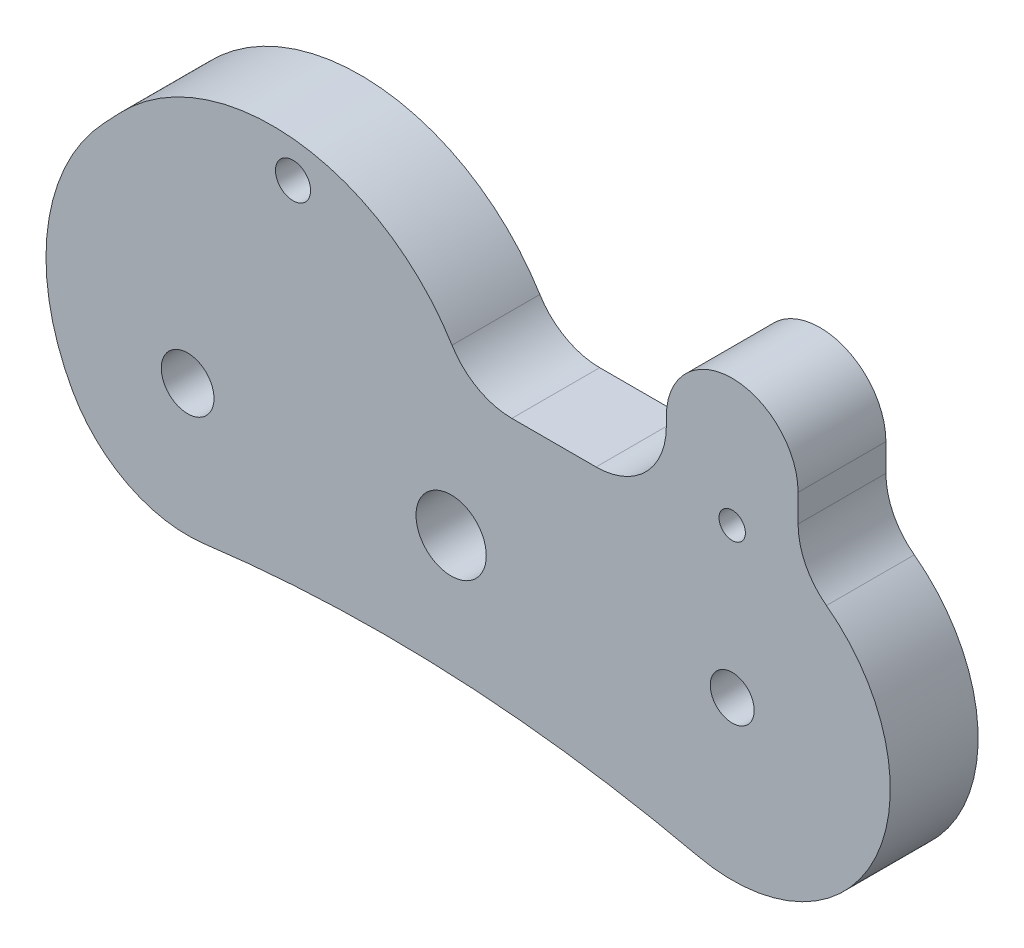
ISO-10303-21;
HEADER;
FILE_DESCRIPTION(('STEP AP214'),'2;1');
FILE_NAME('part.step','',(''),(''),'','','');
FILE_SCHEMA(('AUTOMOTIVE_DESIGN { 1 0 10303 214 1 1 1 1 }'));
ENDSEC;
DATA;
#1=APPLICATION_CONTEXT('core data for automotive mechanical design processes');
#2=APPLICATION_PROTOCOL_DEFINITION('international standard','automotive_design',2000,#1);
#3=PRODUCT_CONTEXT('',#1,'mechanical');
#4=PRODUCT('Part','Part','',(#3));
#5=PRODUCT_RELATED_PRODUCT_CATEGORY('part','',(#4));
#6=PRODUCT_DEFINITION_FORMATION('','',#4);
#7=PRODUCT_DEFINITION_CONTEXT('part definition',#1,'design');
#8=PRODUCT_DEFINITION('design','',#6,#7);
#9=PRODUCT_DEFINITION_SHAPE('','',#8);
#10=(LENGTH_UNIT() NAMED_UNIT(*) SI_UNIT(.MILLI.,.METRE.));
#11=(NAMED_UNIT(*) PLANE_ANGLE_UNIT() SI_UNIT($,.RADIAN.));
#12=(NAMED_UNIT(*) SI_UNIT($,.STERADIAN.) SOLID_ANGLE_UNIT());
#13=UNCERTAINTY_MEASURE_WITH_UNIT(LENGTH_MEASURE(1.E-05),#10,'distance_accuracy_value','');
#14=(GEOMETRIC_REPRESENTATION_CONTEXT(3) GLOBAL_UNCERTAINTY_ASSIGNED_CONTEXT((#13)) GLOBAL_UNIT_ASSIGNED_CONTEXT((#10,
#11,#12)) REPRESENTATION_CONTEXT('',''));
#15=CARTESIAN_POINT('',(0.,0.,0.));
#16=DIRECTION('',(0.,0.,1.));
#17=DIRECTION('',(1.,0.,0.));
#18=AXIS2_PLACEMENT_3D('',#15,#16,#17);
#19=CARTESIAN_POINT('',(23.25,11.5,5.));
#20=DIRECTION('',(0.,0.,-1.));
#21=DIRECTION('',(-1.,0.,0.));
#22=AXIS2_PLACEMENT_3D('',#19,#20,#21);
#23=PLANE('',#22);
#24=CARTESIAN_POINT('',(23.25,11.5,5.));
#25=DIRECTION('',(0.,0.,-1.));
#26=DIRECTION('',(-1.,0.,0.));
#27=AXIS2_PLACEMENT_3D('',#24,#25,#26);
#28=CIRCLE('',#27,4.);
#29=CARTESIAN_POINT('',(27.25,11.5,5.));
#30=VERTEX_POINT('',#29);
#31=CARTESIAN_POINT('',(23.25,7.5,5.));
#32=VERTEX_POINT('',#31);
#33=EDGE_CURVE('E193',#30,#32,#28,.T.);
#34=ORIENTED_EDGE('',*,*,#33,.T.);
#35=DIRECTION('',(-1.,0.,0.));
#36=VECTOR('',#35,1.);
#37=CARTESIAN_POINT('',(18.4574990044832,7.5,5.));
#38=LINE('',#37,#36);
#39=CARTESIAN_POINT('',(18.4574990044832,7.5,5.));
#40=VERTEX_POINT('',#39);
#41=EDGE_CURVE('E116',#32,#40,#38,.T.);
#42=ORIENTED_EDGE('',*,*,#41,.T.);
#43=CARTESIAN_POINT('',(18.4574990044832,11.5,5.));
#44=DIRECTION('',(0.,0.,-1.));
#45=DIRECTION('',(-1.,0.,0.));
#46=AXIS2_PLACEMENT_3D('',#43,#44,#45);
#47=CIRCLE('',#46,4.);
#48=CARTESIAN_POINT('',(15.0502614745966,9.40459254202613,5.));
#49=VERTEX_POINT('',#48);
#50=EDGE_CURVE('E223',#40,#49,#47,.T.);
#51=ORIENTED_EDGE('',*,*,#50,.T.);
#52=CARTESIAN_POINT('',(4.82854888493694,3.11837016810453,5.));
#53=DIRECTION('',(0.,0.,1.));
#54=DIRECTION('',(-1.,0.,0.));
#55=AXIS2_PLACEMENT_3D('',#52,#53,#54);
#56=CIRCLE('',#55,12.);
#57=CARTESIAN_POINT('',(-3.87966329350652,11.3747035343882,5.));
#58=VERTEX_POINT('',#57);
#59=EDGE_CURVE('E242',#49,#58,#56,.T.);
#60=ORIENTED_EDGE('',*,*,#59,.T.);
#61=DIRECTION('',(-0.688027780523639,-0.725684348203622,0.));
#62=VECTOR('',#61,1.);
#63=CARTESIAN_POINT('',(-3.87966329350652,11.3747035343882,5.));
#64=LINE('',#63,#62);
#65=CARTESIAN_POINT('',(-4.77071217844346,10.4348864985253,5.));
#66=VERTEX_POINT('',#65);
#67=EDGE_CURVE('E239',#58,#66,#64,.T.);
#68=ORIENTED_EDGE('',*,*,#67,.T.);
#69=CARTESIAN_POINT('',(3.9375,2.17855313224167,5.));
#70=DIRECTION('',(0.,0.,1.));
#71=DIRECTION('',(-1.,0.,0.));
#72=AXIS2_PLACEMENT_3D('',#69,#70,#71);
#73=CIRCLE('',#72,12.);
#74=CARTESIAN_POINT('',(-6.5625,-3.63092188706945,5.));
#75=VERTEX_POINT('',#74);
#76=EDGE_CURVE('E241',#66,#75,#73,.T.);
#77=ORIENTED_EDGE('',*,*,#76,.T.);
#78=CARTESIAN_POINT('',(0.,0.,5.));
#79=DIRECTION('',(0.,0.,1.));
#80=DIRECTION('',(1.,0.,0.));
#81=AXIS2_PLACEMENT_3D('',#78,#79,#80);
#82=CIRCLE('',#81,7.5);
#83=CARTESIAN_POINT('',(0.962557603686643,-7.43797572324521,5.));
#84=VERTEX_POINT('',#83);
#85=EDGE_CURVE('E244',#75,#84,#82,.T.);
#86=ORIENTED_EDGE('',*,*,#85,.T.);
#87=CARTESIAN_POINT('',(11.2298387096774,-86.7763834378607,5.));
#88=DIRECTION('',(0.,0.,-1.));
#89=DIRECTION('',(-1.,0.,0.));
#90=AXIS2_PLACEMENT_3D('',#87,#88,#89);
#91=CIRCLE('',#90,80.);
#92=CARTESIAN_POINT('',(29.0007702065966,-8.77513989821064,5.));
#93=VERTEX_POINT('',#92);
#94=EDGE_CURVE('E250',#84,#93,#91,.T.);
#95=ORIENTED_EDGE('',*,*,#94,.T.);
#96=CARTESIAN_POINT('',(31.,0.,5.));
#97=DIRECTION('',(0.,0.,1.));
#98=DIRECTION('',(1.,0.,0.));
#99=AXIS2_PLACEMENT_3D('',#96,#97,#98);
#100=CIRCLE('',#99,9.00000000000001);
#101=CARTESIAN_POINT('',(36.3653846153846,7.22583198870512,5.));
#102=VERTEX_POINT('',#101);
#103=EDGE_CURVE('E252',#93,#102,#100,.T.);
#104=ORIENTED_EDGE('',*,*,#103,.T.);
#105=CARTESIAN_POINT('',(38.75,10.4373128725741,5.));
#106=DIRECTION('',(0.,0.,-1.));
#107=DIRECTION('',(-1.,0.,0.));
#108=AXIS2_PLACEMENT_3D('',#105,#106,#107);
#109=CIRCLE('',#108,4.);
#110=CARTESIAN_POINT('',(34.75,10.4373128725741,5.));
#111=VERTEX_POINT('',#110);
#112=EDGE_CURVE('E150',#102,#111,#109,.T.);
#113=ORIENTED_EDGE('',*,*,#112,.T.);
#114=DIRECTION('',(0.,1.,0.));
#115=VECTOR('',#114,1.);
#116=CARTESIAN_POINT('',(34.75,12.,5.));
#117=LINE('',#116,#115);
#118=CARTESIAN_POINT('',(34.75,12.,5.));
#119=VERTEX_POINT('',#118);
#120=EDGE_CURVE('E144',#111,#119,#117,.T.);
#121=ORIENTED_EDGE('',*,*,#120,.T.);
#122=CARTESIAN_POINT('',(31.,12.,5.));
#123=DIRECTION('',(0.,0.,1.));
#124=DIRECTION('',(1.,0.,0.));
#125=AXIS2_PLACEMENT_3D('',#122,#123,#124);
#126=CIRCLE('',#125,3.75);
#127=CARTESIAN_POINT('',(27.25,12.,5.));
#128=VERTEX_POINT('',#127);
#129=EDGE_CURVE('E148',#119,#128,#126,.T.);
#130=ORIENTED_EDGE('',*,*,#129,.T.);
#131=DIRECTION('',(0.,-1.,0.));
#132=VECTOR('',#131,1.);
#133=CARTESIAN_POINT('',(27.25,12.,5.));
#134=LINE('',#133,#132);
#135=EDGE_CURVE('E58',#128,#30,#134,.T.);
#136=ORIENTED_EDGE('',*,*,#135,.T.);
#137=EDGE_LOOP('',(#34,#42,#51,#60,#68,#77,#86,#95,#104,#113,#121,#130,#136));
#138=FACE_BOUND('',#137,.T.);
#139=CARTESIAN_POINT('',(0.,0.,5.));
#140=DIRECTION('',(0.,0.,1.));
#141=DIRECTION('',(1.,0.,0.));
#142=AXIS2_PLACEMENT_3D('',#139,#140,#141);
#143=CIRCLE('',#142,1.5);
#144=CARTESIAN_POINT('',(1.5,0.,5.));
#145=VERTEX_POINT('',#144);
#146=EDGE_CURVE('E172',#145,#145,#143,.T.);
#147=ORIENTED_EDGE('',*,*,#146,.F.);
#148=EDGE_LOOP('',(#147));
#149=FACE_BOUND('',#148,.T.);
#150=CARTESIAN_POINT('',(31.,0.,5.));
#151=DIRECTION('',(0.,0.,1.));
#152=DIRECTION('',(1.,0.,0.));
#153=AXIS2_PLACEMENT_3D('',#150,#151,#152);
#154=CIRCLE('',#153,1.25);
#155=CARTESIAN_POINT('',(32.25,0.,5.));
#156=VERTEX_POINT('',#155);
#157=EDGE_CURVE('E326',#156,#156,#154,.T.);
#158=ORIENTED_EDGE('',*,*,#157,.F.);
#159=EDGE_LOOP('',(#158));
#160=FACE_BOUND('',#159,.T.);
#161=CARTESIAN_POINT('',(15.,0.,5.));
#162=DIRECTION('',(0.,0.,1.));
#163=DIRECTION('',(1.,0.,0.));
#164=AXIS2_PLACEMENT_3D('',#161,#162,#163);
#165=CIRCLE('',#164,2.);
#166=CARTESIAN_POINT('',(17.,0.,5.));
#167=VERTEX_POINT('',#166);
#168=EDGE_CURVE('E320',#167,#167,#165,.T.);
#169=ORIENTED_EDGE('',*,*,#168,.F.);
#170=EDGE_LOOP('',(#169));
#171=FACE_BOUND('',#170,.T.);
#172=CARTESIAN_POINT('',(6.,13.,5.));
#173=DIRECTION('',(0.,0.,1.));
#174=DIRECTION('',(1.,0.,0.));
#175=AXIS2_PLACEMENT_3D('',#172,#173,#174);
#176=CIRCLE('',#175,0.999999999999998);
#177=CARTESIAN_POINT('',(7.,13.,5.));
#178=VERTEX_POINT('',#177);
#179=EDGE_CURVE('E314',#178,#178,#176,.T.);
#180=ORIENTED_EDGE('',*,*,#179,.F.);
#181=EDGE_LOOP('',(#180));
#182=FACE_BOUND('',#181,.T.);
#183=CARTESIAN_POINT('',(31.,8.5,5.));
#184=DIRECTION('',(0.,0.,1.));
#185=DIRECTION('',(1.,0.,0.));
#186=AXIS2_PLACEMENT_3D('',#183,#184,#185);
#187=CIRCLE('',#186,0.749999999999995);
#188=CARTESIAN_POINT('',(31.75,8.5,5.));
#189=VERTEX_POINT('',#188);
#190=EDGE_CURVE('E305',#189,#189,#187,.T.);
#191=ORIENTED_EDGE('',*,*,#190,.F.);
#192=EDGE_LOOP('',(#191));
#193=FACE_BOUND('',#192,.T.);
#194=ADVANCED_FACE('F41',(#138,#149,#160,#171,#182,#193),#23,.F.);
#195=CARTESIAN_POINT('',(23.25,11.5,0.));
#196=DIRECTION('',(0.,0.,-1.));
#197=DIRECTION('',(-1.,0.,0.));
#198=AXIS2_PLACEMENT_3D('',#195,#196,#197);
#199=PLANE('',#198);
#200=CARTESIAN_POINT('',(6.,13.,0.));
#201=DIRECTION('',(0.,0.,1.));
#202=DIRECTION('',(1.,0.,0.));
#203=AXIS2_PLACEMENT_3D('',#200,#201,#202);
#204=CIRCLE('',#203,0.999999999999998);
#205=CARTESIAN_POINT('',(7.,13.,0.));
#206=VERTEX_POINT('',#205);
#207=EDGE_CURVE('E311',#206,#206,#204,.T.);
#208=ORIENTED_EDGE('',*,*,#207,.T.);
#209=EDGE_LOOP('',(#208));
#210=FACE_BOUND('',#209,.T.);
#211=CARTESIAN_POINT('',(31.,0.,0.));
#212=DIRECTION('',(0.,0.,1.));
#213=DIRECTION('',(1.,0.,0.));
#214=AXIS2_PLACEMENT_3D('',#211,#212,#213);
#215=CIRCLE('',#214,1.25);
#216=CARTESIAN_POINT('',(32.25,0.,0.));
#217=VERTEX_POINT('',#216);
#218=EDGE_CURVE('E323',#217,#217,#215,.T.);
#219=ORIENTED_EDGE('',*,*,#218,.T.);
#220=EDGE_LOOP('',(#219));
#221=FACE_BOUND('',#220,.T.);
#222=CARTESIAN_POINT('',(23.25,11.5,0.));
#223=DIRECTION('',(0.,0.,-1.));
#224=DIRECTION('',(-1.,0.,0.));
#225=AXIS2_PLACEMENT_3D('',#222,#223,#224);
#226=CIRCLE('',#225,4.);
#227=CARTESIAN_POINT('',(27.25,11.5,0.));
#228=VERTEX_POINT('',#227);
#229=CARTESIAN_POINT('',(23.25,7.5,0.));
#230=VERTEX_POINT('',#229);
#231=EDGE_CURVE('E168',#228,#230,#226,.T.);
#232=ORIENTED_EDGE('',*,*,#231,.F.);
#233=DIRECTION('',(0.,-1.,0.));
#234=VECTOR('',#233,1.);
#235=CARTESIAN_POINT('',(27.25,12.,0.));
#236=LINE('',#235,#234);
#237=CARTESIAN_POINT('',(27.25,12.,0.));
#238=VERTEX_POINT('',#237);
#239=EDGE_CURVE('E108',#238,#228,#236,.T.);
#240=ORIENTED_EDGE('',*,*,#239,.F.);
#241=CARTESIAN_POINT('',(31.,12.,0.));
#242=DIRECTION('',(0.,0.,1.));
#243=DIRECTION('',(1.,0.,0.));
#244=AXIS2_PLACEMENT_3D('',#241,#242,#243);
#245=CIRCLE('',#244,3.75);
#246=CARTESIAN_POINT('',(34.75,12.,0.));
#247=VERTEX_POINT('',#246);
#248=EDGE_CURVE('E102',#247,#238,#245,.T.);
#249=ORIENTED_EDGE('',*,*,#248,.F.);
#250=DIRECTION('',(0.,1.,0.));
#251=VECTOR('',#250,1.);
#252=CARTESIAN_POINT('',(34.75,12.,0.));
#253=LINE('',#252,#251);
#254=CARTESIAN_POINT('',(34.75,10.4373128725741,0.));
#255=VERTEX_POINT('',#254);
#256=EDGE_CURVE('E158',#255,#247,#253,.T.);
#257=ORIENTED_EDGE('',*,*,#256,.F.);
#258=CARTESIAN_POINT('',(38.75,10.4373128725741,0.));
#259=DIRECTION('',(0.,0.,-1.));
#260=DIRECTION('',(-1.,0.,0.));
#261=AXIS2_PLACEMENT_3D('',#258,#259,#260);
#262=CIRCLE('',#261,4.);
#263=CARTESIAN_POINT('',(36.3653846153846,7.22583198870512,0.));
#264=VERTEX_POINT('',#263);
#265=EDGE_CURVE('E188',#264,#255,#262,.T.);
#266=ORIENTED_EDGE('',*,*,#265,.F.);
#267=CARTESIAN_POINT('',(31.,0.,0.));
#268=DIRECTION('',(0.,0.,1.));
#269=DIRECTION('',(1.,0.,0.));
#270=AXIS2_PLACEMENT_3D('',#267,#268,#269);
#271=CIRCLE('',#270,9.00000000000001);
#272=CARTESIAN_POINT('',(29.0007702065966,-8.77513989821064,0.));
#273=VERTEX_POINT('',#272);
#274=EDGE_CURVE('E186',#273,#264,#271,.T.);
#275=ORIENTED_EDGE('',*,*,#274,.F.);
#276=CARTESIAN_POINT('',(11.2298387096774,-86.7763834378607,0.));
#277=DIRECTION('',(0.,0.,-1.));
#278=DIRECTION('',(-1.,0.,0.));
#279=AXIS2_PLACEMENT_3D('',#276,#277,#278);
#280=CIRCLE('',#279,80.);
#281=CARTESIAN_POINT('',(0.962557603686643,-7.43797572324521,0.));
#282=VERTEX_POINT('',#281);
#283=EDGE_CURVE('E184',#282,#273,#280,.T.);
#284=ORIENTED_EDGE('',*,*,#283,.F.);
#285=CARTESIAN_POINT('',(0.,0.,0.));
#286=DIRECTION('',(0.,0.,1.));
#287=DIRECTION('',(1.,0.,0.));
#288=AXIS2_PLACEMENT_3D('',#285,#286,#287);
#289=CIRCLE('',#288,7.5);
#290=CARTESIAN_POINT('',(-6.5625,-3.63092188706945,0.));
#291=VERTEX_POINT('',#290);
#292=EDGE_CURVE('E182',#291,#282,#289,.T.);
#293=ORIENTED_EDGE('',*,*,#292,.F.);
#294=CARTESIAN_POINT('',(3.9375,2.17855313224167,0.));
#295=DIRECTION('',(0.,0.,1.));
#296=DIRECTION('',(-1.,0.,0.));
#297=AXIS2_PLACEMENT_3D('',#294,#295,#296);
#298=CIRCLE('',#297,12.);
#299=CARTESIAN_POINT('',(-4.77071217844346,10.4348864985253,0.));
#300=VERTEX_POINT('',#299);
#301=EDGE_CURVE('E180',#300,#291,#298,.T.);
#302=ORIENTED_EDGE('',*,*,#301,.F.);
#303=DIRECTION('',(-0.688027780523639,-0.725684348203622,0.));
#304=VECTOR('',#303,1.);
#305=CARTESIAN_POINT('',(-3.87966329350652,11.3747035343882,0.));
#306=LINE('',#305,#304);
#307=CARTESIAN_POINT('',(-3.87966329350652,11.3747035343882,0.));
#308=VERTEX_POINT('',#307);
#309=EDGE_CURVE('E178',#308,#300,#306,.T.);
#310=ORIENTED_EDGE('',*,*,#309,.F.);
#311=CARTESIAN_POINT('',(4.82854888493694,3.11837016810453,0.));
#312=DIRECTION('',(0.,0.,1.));
#313=DIRECTION('',(-1.,0.,0.));
#314=AXIS2_PLACEMENT_3D('',#311,#312,#313);
#315=CIRCLE('',#314,12.);
#316=CARTESIAN_POINT('',(15.0502614745966,9.40459254202613,0.));
#317=VERTEX_POINT('',#316);
#318=EDGE_CURVE('E176',#317,#308,#315,.T.);
#319=ORIENTED_EDGE('',*,*,#318,.F.);
#320=CARTESIAN_POINT('',(18.4574990044832,11.5,0.));
#321=DIRECTION('',(0.,0.,-1.));
#322=DIRECTION('',(-1.,0.,0.));
#323=AXIS2_PLACEMENT_3D('',#320,#321,#322);
#324=CIRCLE('',#323,4.);
#325=CARTESIAN_POINT('',(18.4574990044832,7.5,0.));
#326=VERTEX_POINT('',#325);
#327=EDGE_CURVE('E174',#326,#317,#324,.T.);
#328=ORIENTED_EDGE('',*,*,#327,.F.);
#329=DIRECTION('',(-1.,0.,0.));
#330=VECTOR('',#329,1.);
#331=CARTESIAN_POINT('',(18.4574990044832,7.5,0.));
#332=LINE('',#331,#330);
#333=EDGE_CURVE('E171',#230,#326,#332,.T.);
#334=ORIENTED_EDGE('',*,*,#333,.F.);
#335=EDGE_LOOP('',(#232,#240,#249,#257,#266,#275,#284,#293,#302,#310,#319,#328,#334));
#336=FACE_BOUND('',#335,.T.);
#337=CARTESIAN_POINT('',(0.,0.,0.));
#338=DIRECTION('',(0.,0.,1.));
#339=DIRECTION('',(1.,0.,0.));
#340=AXIS2_PLACEMENT_3D('',#337,#338,#339);
#341=CIRCLE('',#340,1.5);
#342=CARTESIAN_POINT('',(1.5,0.,0.));
#343=VERTEX_POINT('',#342);
#344=EDGE_CURVE('E329',#343,#343,#341,.T.);
#345=ORIENTED_EDGE('',*,*,#344,.T.);
#346=EDGE_LOOP('',(#345));
#347=FACE_BOUND('',#346,.T.);
#348=CARTESIAN_POINT('',(15.,0.,0.));
#349=DIRECTION('',(0.,0.,1.));
#350=DIRECTION('',(1.,0.,0.));
#351=AXIS2_PLACEMENT_3D('',#348,#349,#350);
#352=CIRCLE('',#351,2.);
#353=CARTESIAN_POINT('',(17.,0.,0.));
#354=VERTEX_POINT('',#353);
#355=EDGE_CURVE('E317',#354,#354,#352,.T.);
#356=ORIENTED_EDGE('',*,*,#355,.T.);
#357=EDGE_LOOP('',(#356));
#358=FACE_BOUND('',#357,.T.);
#359=CARTESIAN_POINT('',(31.,8.5,0.));
#360=DIRECTION('',(0.,0.,1.));
#361=DIRECTION('',(1.,0.,0.));
#362=AXIS2_PLACEMENT_3D('',#359,#360,#361);
#363=CIRCLE('',#362,0.749999999999995);
#364=CARTESIAN_POINT('',(31.75,8.5,0.));
#365=VERTEX_POINT('',#364);
#366=EDGE_CURVE('E308',#365,#365,#363,.T.);
#367=ORIENTED_EDGE('',*,*,#366,.T.);
#368=EDGE_LOOP('',(#367));
#369=FACE_BOUND('',#368,.T.);
#370=ADVANCED_FACE('F227',(#210,#221,#336,#347,#358,#369),#199,.T.);
#371=CARTESIAN_POINT('',(23.25,11.5,5.));
#372=DIRECTION('',(0.,0.,-1.));
#373=DIRECTION('',(-1.,0.,0.));
#374=AXIS2_PLACEMENT_3D('',#371,#372,#373);
#375=CYLINDRICAL_SURFACE('',#374,4.);
#376=ORIENTED_EDGE('',*,*,#231,.T.);
#377=DIRECTION('',(0.,0.,-1.));
#378=VECTOR('',#377,1.);
#379=CARTESIAN_POINT('',(23.25,7.5,5.));
#380=LINE('',#379,#378);
#381=EDGE_CURVE('E11',#32,#230,#380,.T.);
#382=ORIENTED_EDGE('',*,*,#381,.F.);
#383=ORIENTED_EDGE('',*,*,#33,.F.);
#384=DIRECTION('',(0.,0.,-1.));
#385=VECTOR('',#384,1.);
#386=CARTESIAN_POINT('',(27.25,11.5,5.));
#387=LINE('',#386,#385);
#388=EDGE_CURVE('E164',#30,#228,#387,.T.);
#389=ORIENTED_EDGE('',*,*,#388,.T.);
#390=EDGE_LOOP('',(#376,#382,#383,#389));
#391=FACE_BOUND('',#390,.T.);
#392=ADVANCED_FACE('F43',(#391),#375,.F.);
#393=CARTESIAN_POINT('',(18.4574990044832,7.5,5.));
#394=DIRECTION('',(0.,-1.,0.));
#395=DIRECTION('',(0.,0.,-1.));
#396=AXIS2_PLACEMENT_3D('',#393,#394,#395);
#397=PLANE('',#396);
#398=ORIENTED_EDGE('',*,*,#333,.T.);
#399=DIRECTION('',(0.,0.,-1.));
#400=VECTOR('',#399,1.);
#401=CARTESIAN_POINT('',(18.4574990044832,7.5,5.));
#402=LINE('',#401,#400);
#403=EDGE_CURVE('E50',#40,#326,#402,.T.);
#404=ORIENTED_EDGE('',*,*,#403,.F.);
#405=ORIENTED_EDGE('',*,*,#41,.F.);
#406=ORIENTED_EDGE('',*,*,#381,.T.);
#407=EDGE_LOOP('',(#398,#404,#405,#406));
#408=FACE_BOUND('',#407,.T.);
#409=ADVANCED_FACE('F414',(#408),#397,.F.);
#410=CARTESIAN_POINT('',(18.4574990044832,11.5,5.));
#411=DIRECTION('',(0.,0.,-1.));
#412=DIRECTION('',(-1.,0.,0.));
#413=AXIS2_PLACEMENT_3D('',#410,#411,#412);
#414=CYLINDRICAL_SURFACE('',#413,4.);
#415=ORIENTED_EDGE('',*,*,#327,.T.);
#416=DIRECTION('',(0.,0.,-1.));
#417=VECTOR('',#416,1.);
#418=CARTESIAN_POINT('',(15.0502614745966,9.40459254202613,5.));
#419=LINE('',#418,#417);
#420=EDGE_CURVE('E215',#49,#317,#419,.T.);
#421=ORIENTED_EDGE('',*,*,#420,.F.);
#422=ORIENTED_EDGE('',*,*,#50,.F.);
#423=ORIENTED_EDGE('',*,*,#403,.T.);
#424=EDGE_LOOP('',(#415,#421,#422,#423));
#425=FACE_BOUND('',#424,.T.);
#426=ADVANCED_FACE('F221',(#425),#414,.F.);
#427=CARTESIAN_POINT('',(4.82854888493694,3.11837016810453,5.));
#428=DIRECTION('',(0.,0.,-1.));
#429=DIRECTION('',(-1.,0.,0.));
#430=AXIS2_PLACEMENT_3D('',#427,#428,#429);
#431=CYLINDRICAL_SURFACE('',#430,12.);
#432=ORIENTED_EDGE('',*,*,#318,.T.);
#433=DIRECTION('',(0.,0.,-1.));
#434=VECTOR('',#433,1.);
#435=CARTESIAN_POINT('',(-3.87966329350652,11.3747035343882,5.));
#436=LINE('',#435,#434);
#437=EDGE_CURVE('E212',#58,#308,#436,.T.);
#438=ORIENTED_EDGE('',*,*,#437,.F.);
#439=ORIENTED_EDGE('',*,*,#59,.F.);
#440=ORIENTED_EDGE('',*,*,#420,.T.);
#441=EDGE_LOOP('',(#432,#438,#439,#440));
#442=FACE_BOUND('',#441,.T.);
#443=ADVANCED_FACE('F233',(#442),#431,.T.);
#444=CARTESIAN_POINT('',(-3.87966329350652,11.3747035343882,5.));
#445=DIRECTION('',(0.725684348203622,-0.688027780523639,0.));
#446=DIRECTION('',(0.688027780523639,0.725684348203622,0.));
#447=AXIS2_PLACEMENT_3D('',#444,#445,#446);
#448=PLANE('',#447);
#449=ORIENTED_EDGE('',*,*,#309,.T.);
#450=DIRECTION('',(0.,0.,-1.));
#451=VECTOR('',#450,1.);
#452=CARTESIAN_POINT('',(-4.77071217844346,10.4348864985253,5.));
#453=LINE('',#452,#451);
#454=EDGE_CURVE('E209',#66,#300,#453,.T.);
#455=ORIENTED_EDGE('',*,*,#454,.F.);
#456=ORIENTED_EDGE('',*,*,#67,.F.);
#457=ORIENTED_EDGE('',*,*,#437,.T.);
#458=EDGE_LOOP('',(#449,#455,#456,#457));
#459=FACE_BOUND('',#458,.T.);
#460=ADVANCED_FACE('F237',(#459),#448,.F.);
#461=CARTESIAN_POINT('',(3.9375,2.17855313224167,5.));
#462=DIRECTION('',(0.,0.,-1.));
#463=DIRECTION('',(-1.,0.,0.));
#464=AXIS2_PLACEMENT_3D('',#461,#462,#463);
#465=CYLINDRICAL_SURFACE('',#464,12.);
#466=ORIENTED_EDGE('',*,*,#301,.T.);
#467=DIRECTION('',(0.,0.,-1.));
#468=VECTOR('',#467,1.);
#469=CARTESIAN_POINT('',(-6.5625,-3.63092188706945,5.));
#470=LINE('',#469,#468);
#471=EDGE_CURVE('E206',#75,#291,#470,.T.);
#472=ORIENTED_EDGE('',*,*,#471,.F.);
#473=ORIENTED_EDGE('',*,*,#76,.F.);
#474=ORIENTED_EDGE('',*,*,#454,.T.);
#475=EDGE_LOOP('',(#466,#472,#473,#474));
#476=FACE_BOUND('',#475,.T.);
#477=ADVANCED_FACE('F445',(#476),#465,.T.);
#478=CARTESIAN_POINT('',(0.,0.,5.));
#479=DIRECTION('',(0.,0.,-1.));
#480=DIRECTION('',(-1.,0.,0.));
#481=AXIS2_PLACEMENT_3D('',#478,#479,#480);
#482=CYLINDRICAL_SURFACE('',#481,7.5);
#483=ORIENTED_EDGE('',*,*,#292,.T.);
#484=DIRECTION('',(0.,0.,-1.));
#485=VECTOR('',#484,1.);
#486=CARTESIAN_POINT('',(0.962557603686643,-7.43797572324521,5.));
#487=LINE('',#486,#485);
#488=EDGE_CURVE('E203',#84,#282,#487,.T.);
#489=ORIENTED_EDGE('',*,*,#488,.F.);
#490=ORIENTED_EDGE('',*,*,#85,.F.);
#491=ORIENTED_EDGE('',*,*,#471,.T.);
#492=EDGE_LOOP('',(#483,#489,#490,#491));
#493=FACE_BOUND('',#492,.T.);
#494=ADVANCED_FACE('F454',(#493),#482,.T.);
#495=CARTESIAN_POINT('',(11.2298387096774,-86.7763834378607,5.));
#496=DIRECTION('',(0.,0.,-1.));
#497=DIRECTION('',(-1.,0.,0.));
#498=AXIS2_PLACEMENT_3D('',#495,#496,#497);
#499=CYLINDRICAL_SURFACE('',#498,80.);
#500=ORIENTED_EDGE('',*,*,#283,.T.);
#501=DIRECTION('',(0.,0.,-1.));
#502=VECTOR('',#501,1.);
#503=CARTESIAN_POINT('',(29.0007702065966,-8.77513989821064,5.));
#504=LINE('',#503,#502);
#505=EDGE_CURVE('E200',#93,#273,#504,.T.);
#506=ORIENTED_EDGE('',*,*,#505,.F.);
#507=ORIENTED_EDGE('',*,*,#94,.F.);
#508=ORIENTED_EDGE('',*,*,#488,.T.);
#509=EDGE_LOOP('',(#500,#506,#507,#508));
#510=FACE_BOUND('',#509,.T.);
#511=ADVANCED_FACE('F464',(#510),#499,.F.);
#512=CARTESIAN_POINT('',(31.,0.,5.));
#513=DIRECTION('',(0.,0.,-1.));
#514=DIRECTION('',(-1.,0.,0.));
#515=AXIS2_PLACEMENT_3D('',#512,#513,#514);
#516=CYLINDRICAL_SURFACE('',#515,9.00000000000001);
#517=ORIENTED_EDGE('',*,*,#274,.T.);
#518=DIRECTION('',(0.,0.,-1.));
#519=VECTOR('',#518,1.);
#520=CARTESIAN_POINT('',(36.3653846153846,7.22583198870512,5.));
#521=LINE('',#520,#519);
#522=EDGE_CURVE('E197',#102,#264,#521,.T.);
#523=ORIENTED_EDGE('',*,*,#522,.F.);
#524=ORIENTED_EDGE('',*,*,#103,.F.);
#525=ORIENTED_EDGE('',*,*,#505,.T.);
#526=EDGE_LOOP('',(#517,#523,#524,#525));
#527=FACE_BOUND('',#526,.T.);
#528=ADVANCED_FACE('F258',(#527),#516,.T.);
#529=CARTESIAN_POINT('',(38.75,10.4373128725741,5.));
#530=DIRECTION('',(0.,0.,-1.));
#531=DIRECTION('',(-1.,0.,0.));
#532=AXIS2_PLACEMENT_3D('',#529,#530,#531);
#533=CYLINDRICAL_SURFACE('',#532,4.);
#534=ORIENTED_EDGE('',*,*,#265,.T.);
#535=DIRECTION('',(0.,0.,-1.));
#536=VECTOR('',#535,1.);
#537=CARTESIAN_POINT('',(34.75,10.4373128725741,5.));
#538=LINE('',#537,#536);
#539=EDGE_CURVE('E159',#111,#255,#538,.T.);
#540=ORIENTED_EDGE('',*,*,#539,.F.);
#541=ORIENTED_EDGE('',*,*,#112,.F.);
#542=ORIENTED_EDGE('',*,*,#522,.T.);
#543=EDGE_LOOP('',(#534,#540,#541,#542));
#544=FACE_BOUND('',#543,.T.);
#545=ADVANCED_FACE('F262',(#544),#533,.F.);
#546=CARTESIAN_POINT('',(34.75,12.,5.));
#547=DIRECTION('',(-1.,0.,0.));
#548=DIRECTION('',(0.,0.,1.));
#549=AXIS2_PLACEMENT_3D('',#546,#547,#548);
#550=PLANE('',#549);
#551=ORIENTED_EDGE('',*,*,#256,.T.);
#552=DIRECTION('',(0.,0.,-1.));
#553=VECTOR('',#552,1.);
#554=CARTESIAN_POINT('',(34.75,12.,5.));
#555=LINE('',#554,#553);
#556=EDGE_CURVE('E155',#119,#247,#555,.T.);
#557=ORIENTED_EDGE('',*,*,#556,.F.);
#558=ORIENTED_EDGE('',*,*,#120,.F.);
#559=ORIENTED_EDGE('',*,*,#539,.T.);
#560=EDGE_LOOP('',(#551,#557,#558,#559));
#561=FACE_BOUND('',#560,.T.);
#562=ADVANCED_FACE('F156',(#561),#550,.F.);
#563=CARTESIAN_POINT('',(31.,12.,5.));
#564=DIRECTION('',(0.,0.,-1.));
#565=DIRECTION('',(-1.,0.,0.));
#566=AXIS2_PLACEMENT_3D('',#563,#564,#565);
#567=CYLINDRICAL_SURFACE('',#566,3.75);
#568=ORIENTED_EDGE('',*,*,#248,.T.);
#569=DIRECTION('',(0.,0.,-1.));
#570=VECTOR('',#569,1.);
#571=CARTESIAN_POINT('',(27.25,12.,5.));
#572=LINE('',#571,#570);
#573=EDGE_CURVE('E160',#128,#238,#572,.T.);
#574=ORIENTED_EDGE('',*,*,#573,.F.);
#575=ORIENTED_EDGE('',*,*,#129,.F.);
#576=ORIENTED_EDGE('',*,*,#556,.T.);
#577=EDGE_LOOP('',(#568,#574,#575,#576));
#578=FACE_BOUND('',#577,.T.);
#579=ADVANCED_FACE('F162',(#578),#567,.T.);
#580=CARTESIAN_POINT('',(27.25,12.,5.));
#581=DIRECTION('',(1.,0.,0.));
#582=DIRECTION('',(0.,0.,-1.));
#583=AXIS2_PLACEMENT_3D('',#580,#581,#582);
#584=PLANE('',#583);
#585=ORIENTED_EDGE('',*,*,#239,.T.);
#586=ORIENTED_EDGE('',*,*,#388,.F.);
#587=ORIENTED_EDGE('',*,*,#135,.F.);
#588=ORIENTED_EDGE('',*,*,#573,.T.);
#589=EDGE_LOOP('',(#585,#586,#587,#588));
#590=FACE_BOUND('',#589,.T.);
#591=ADVANCED_FACE('F266',(#590),#584,.F.);
#592=CARTESIAN_POINT('',(0.,0.,5.));
#593=DIRECTION('',(0.,0.,-1.));
#594=DIRECTION('',(-1.,0.,0.));
#595=AXIS2_PLACEMENT_3D('',#592,#593,#594);
#596=CYLINDRICAL_SURFACE('',#595,1.5);
#597=ORIENTED_EDGE('',*,*,#146,.T.);
#598=EDGE_LOOP('',(#597));
#599=FACE_BOUND('',#598,.T.);
#600=ORIENTED_EDGE('',*,*,#344,.F.);
#601=EDGE_LOOP('',(#600));
#602=FACE_BOUND('',#601,.T.);
#603=ADVANCED_FACE('F268',(#599,#602),#596,.F.);
#604=CARTESIAN_POINT('',(31.,0.,5.));
#605=DIRECTION('',(0.,0.,-1.));
#606=DIRECTION('',(-1.,0.,0.));
#607=AXIS2_PLACEMENT_3D('',#604,#605,#606);
#608=CYLINDRICAL_SURFACE('',#607,1.25);
#609=ORIENTED_EDGE('',*,*,#157,.T.);
#610=EDGE_LOOP('',(#609));
#611=FACE_BOUND('',#610,.T.);
#612=ORIENTED_EDGE('',*,*,#218,.F.);
#613=EDGE_LOOP('',(#612));
#614=FACE_BOUND('',#613,.T.);
#615=ADVANCED_FACE('F274',(#611,#614),#608,.F.);
#616=CARTESIAN_POINT('',(15.,0.,5.));
#617=DIRECTION('',(0.,0.,-1.));
#618=DIRECTION('',(-1.,0.,0.));
#619=AXIS2_PLACEMENT_3D('',#616,#617,#618);
#620=CYLINDRICAL_SURFACE('',#619,2.);
#621=ORIENTED_EDGE('',*,*,#168,.T.);
#622=EDGE_LOOP('',(#621));
#623=FACE_BOUND('',#622,.T.);
#624=ORIENTED_EDGE('',*,*,#355,.F.);
#625=EDGE_LOOP('',(#624));
#626=FACE_BOUND('',#625,.T.);
#627=ADVANCED_FACE('F288',(#623,#626),#620,.F.);
#628=CARTESIAN_POINT('',(6.,13.,5.));
#629=DIRECTION('',(0.,0.,-1.));
#630=DIRECTION('',(-1.,0.,0.));
#631=AXIS2_PLACEMENT_3D('',#628,#629,#630);
#632=CYLINDRICAL_SURFACE('',#631,0.999999999999998);
#633=ORIENTED_EDGE('',*,*,#179,.T.);
#634=EDGE_LOOP('',(#633));
#635=FACE_BOUND('',#634,.T.);
#636=ORIENTED_EDGE('',*,*,#207,.F.);
#637=EDGE_LOOP('',(#636));
#638=FACE_BOUND('',#637,.T.);
#639=ADVANCED_FACE('F292',(#635,#638),#632,.F.);
#640=CARTESIAN_POINT('',(31.,8.5,5.));
#641=DIRECTION('',(0.,0.,-1.));
#642=DIRECTION('',(-1.,0.,0.));
#643=AXIS2_PLACEMENT_3D('',#640,#641,#642);
#644=CYLINDRICAL_SURFACE('',#643,0.749999999999995);
#645=ORIENTED_EDGE('',*,*,#190,.T.);
#646=EDGE_LOOP('',(#645));
#647=FACE_BOUND('',#646,.T.);
#648=ORIENTED_EDGE('',*,*,#366,.F.);
#649=EDGE_LOOP('',(#648));
#650=FACE_BOUND('',#649,.T.);
#651=ADVANCED_FACE('F296',(#647,#650),#644,.F.);
#652=CLOSED_SHELL('',(#194,#370,#392,#409,#426,#443,#460,#477,#494,#511,#528,#545,#562,#579,
#591,#603,#615,#627,#639,#651));
#653=MANIFOLD_SOLID_BREP('B2',#652);
#654=ADVANCED_BREP_SHAPE_REPRESENTATION('',(#18,#653),#14);
#655=SHAPE_DEFINITION_REPRESENTATION(#9,#654);
ENDSEC;
END-ISO-10303-21;
